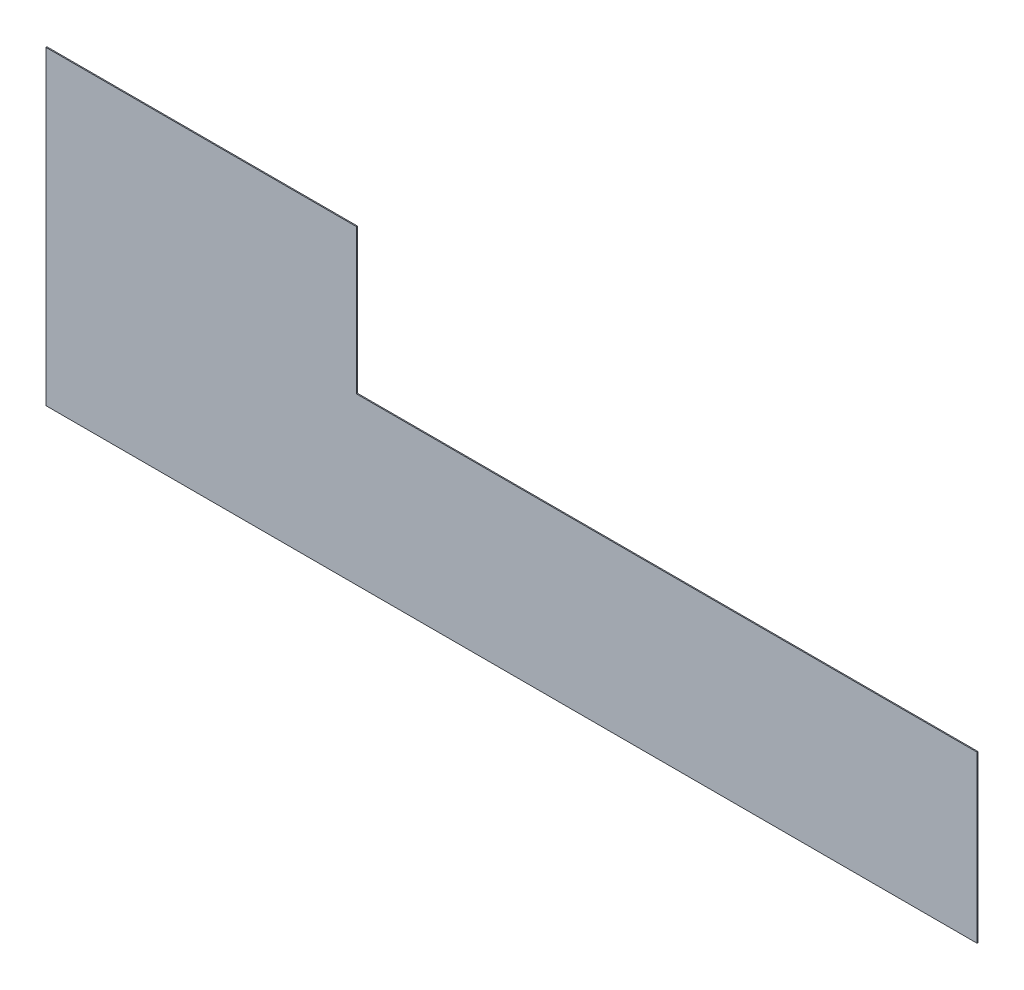
ISO-10303-21;
HEADER;
FILE_DESCRIPTION(('STEP AP214'),'2;1');
FILE_NAME('part.step','',(''),(''),'','','');
FILE_SCHEMA(('AUTOMOTIVE_DESIGN { 1 0 10303 214 1 1 1 1 }'));
ENDSEC;
DATA;
#1=APPLICATION_CONTEXT('core data for automotive mechanical design processes');
#2=APPLICATION_PROTOCOL_DEFINITION('international standard','automotive_design',2000,#1);
#3=PRODUCT_CONTEXT('',#1,'mechanical');
#4=PRODUCT('Part','Part','',(#3));
#5=PRODUCT_RELATED_PRODUCT_CATEGORY('part','',(#4));
#6=PRODUCT_DEFINITION_FORMATION('','',#4);
#7=PRODUCT_DEFINITION_CONTEXT('part definition',#1,'design');
#8=PRODUCT_DEFINITION('design','',#6,#7);
#9=PRODUCT_DEFINITION_SHAPE('','',#8);
#10=(LENGTH_UNIT() NAMED_UNIT(*) SI_UNIT(.MILLI.,.METRE.));
#11=(NAMED_UNIT(*) PLANE_ANGLE_UNIT() SI_UNIT($,.RADIAN.));
#12=(NAMED_UNIT(*) SI_UNIT($,.STERADIAN.) SOLID_ANGLE_UNIT());
#13=UNCERTAINTY_MEASURE_WITH_UNIT(LENGTH_MEASURE(1.E-05),#10,'distance_accuracy_value','');
#14=(GEOMETRIC_REPRESENTATION_CONTEXT(3) GLOBAL_UNCERTAINTY_ASSIGNED_CONTEXT((#13)) GLOBAL_UNIT_ASSIGNED_CONTEXT((#10,
#11,#12)) REPRESENTATION_CONTEXT('',''));
#15=CARTESIAN_POINT('',(0.,0.,0.));
#16=DIRECTION('',(0.,0.,1.));
#17=DIRECTION('',(1.,0.,0.));
#18=AXIS2_PLACEMENT_3D('',#15,#16,#17);
#19=CARTESIAN_POINT('',(455.448110470739,0.,1.));
#20=DIRECTION('',(-1.,0.,0.));
#21=DIRECTION('',(0.,0.,1.));
#22=AXIS2_PLACEMENT_3D('',#19,#20,#21);
#23=PLANE('',#22);
#24=DIRECTION('',(0.,1.,0.));
#25=VECTOR('',#24,1.);
#26=CARTESIAN_POINT('',(455.448110470739,0.,0.));
#27=LINE('',#26,#25);
#28=CARTESIAN_POINT('',(455.448110470739,-160.,0.));
#29=VERTEX_POINT('',#28);
#30=CARTESIAN_POINT('',(455.448110470739,0.,0.));
#31=VERTEX_POINT('',#30);
#32=EDGE_CURVE('E116',#29,#31,#27,.T.);
#33=ORIENTED_EDGE('',*,*,#32,.T.);
#34=DIRECTION('',(0.,0.,-1.));
#35=VECTOR('',#34,1.);
#36=CARTESIAN_POINT('',(455.448110470739,0.,1.));
#37=LINE('',#36,#35);
#38=CARTESIAN_POINT('',(455.448110470739,0.,1.));
#39=VERTEX_POINT('',#38);
#40=EDGE_CURVE('E11',#39,#31,#37,.T.);
#41=ORIENTED_EDGE('',*,*,#40,.F.);
#42=DIRECTION('',(0.,1.,0.));
#43=VECTOR('',#42,1.);
#44=CARTESIAN_POINT('',(455.448110470739,0.,1.));
#45=LINE('',#44,#43);
#46=CARTESIAN_POINT('',(455.448110470739,-160.,1.));
#47=VERTEX_POINT('',#46);
#48=EDGE_CURVE('E126',#47,#39,#45,.T.);
#49=ORIENTED_EDGE('',*,*,#48,.F.);
#50=DIRECTION('',(0.,0.,-1.));
#51=VECTOR('',#50,1.);
#52=CARTESIAN_POINT('',(455.448110470739,-160.,1.));
#53=LINE('',#52,#51);
#54=EDGE_CURVE('E112',#47,#29,#53,.T.);
#55=ORIENTED_EDGE('',*,*,#54,.T.);
#56=EDGE_LOOP('',(#33,#41,#49,#55));
#57=FACE_BOUND('',#56,.T.);
#58=ADVANCED_FACE('F32',(#57),#23,.F.);
#59=CARTESIAN_POINT('',(-144.551889529261,0.,1.));
#60=DIRECTION('',(0.,-1.,0.));
#61=DIRECTION('',(0.,0.,-1.));
#62=AXIS2_PLACEMENT_3D('',#59,#60,#61);
#63=PLANE('',#62);
#64=DIRECTION('',(-1.,0.,0.));
#65=VECTOR('',#64,1.);
#66=CARTESIAN_POINT('',(-144.551889529261,0.,0.));
#67=LINE('',#66,#65);
#68=CARTESIAN_POINT('',(-144.551889529261,0.,0.));
#69=VERTEX_POINT('',#68);
#70=EDGE_CURVE('E119',#31,#69,#67,.T.);
#71=ORIENTED_EDGE('',*,*,#70,.T.);
#72=DIRECTION('',(0.,0.,-1.));
#73=VECTOR('',#72,1.);
#74=CARTESIAN_POINT('',(-144.551889529261,0.,1.));
#75=LINE('',#74,#73);
#76=CARTESIAN_POINT('',(-144.551889529261,0.,1.));
#77=VERTEX_POINT('',#76);
#78=EDGE_CURVE('E40',#77,#69,#75,.T.);
#79=ORIENTED_EDGE('',*,*,#78,.F.);
#80=DIRECTION('',(-1.,0.,0.));
#81=VECTOR('',#80,1.);
#82=CARTESIAN_POINT('',(-144.551889529261,0.,1.));
#83=LINE('',#82,#81);
#84=EDGE_CURVE('E85',#39,#77,#83,.T.);
#85=ORIENTED_EDGE('',*,*,#84,.F.);
#86=ORIENTED_EDGE('',*,*,#40,.T.);
#87=EDGE_LOOP('',(#71,#79,#85,#86));
#88=FACE_BOUND('',#87,.T.);
#89=ADVANCED_FACE('F150',(#88),#63,.F.);
#90=CARTESIAN_POINT('',(-144.551889529261,0.,1.));
#91=DIRECTION('',(-1.,0.,0.));
#92=DIRECTION('',(0.,0.,1.));
#93=AXIS2_PLACEMENT_3D('',#90,#91,#92);
#94=PLANE('',#93);
#95=DIRECTION('',(0.,1.,0.));
#96=VECTOR('',#95,1.);
#97=CARTESIAN_POINT('',(-144.551889529261,0.,0.));
#98=LINE('',#97,#96);
#99=CARTESIAN_POINT('',(-144.551889529261,140.,0.));
#100=VERTEX_POINT('',#99);
#101=EDGE_CURVE('E121',#69,#100,#98,.T.);
#102=ORIENTED_EDGE('',*,*,#101,.T.);
#103=DIRECTION('',(0.,0.,-1.));
#104=VECTOR('',#103,1.);
#105=CARTESIAN_POINT('',(-144.551889529261,140.,1.));
#106=LINE('',#105,#104);
#107=CARTESIAN_POINT('',(-144.551889529261,140.,1.));
#108=VERTEX_POINT('',#107);
#109=EDGE_CURVE('E107',#108,#100,#106,.T.);
#110=ORIENTED_EDGE('',*,*,#109,.F.);
#111=DIRECTION('',(0.,1.,0.));
#112=VECTOR('',#111,1.);
#113=CARTESIAN_POINT('',(-144.551889529261,0.,1.));
#114=LINE('',#113,#112);
#115=EDGE_CURVE('E98',#77,#108,#114,.T.);
#116=ORIENTED_EDGE('',*,*,#115,.F.);
#117=ORIENTED_EDGE('',*,*,#78,.T.);
#118=EDGE_LOOP('',(#102,#110,#116,#117));
#119=FACE_BOUND('',#118,.T.);
#120=ADVANCED_FACE('F132',(#119),#94,.F.);
#121=CARTESIAN_POINT('',(-444.551889529261,140.,1.));
#122=DIRECTION('',(0.,-1.,0.));
#123=DIRECTION('',(0.,0.,-1.));
#124=AXIS2_PLACEMENT_3D('',#121,#122,#123);
#125=PLANE('',#124);
#126=DIRECTION('',(-1.,0.,0.));
#127=VECTOR('',#126,1.);
#128=CARTESIAN_POINT('',(-444.551889529261,140.,0.));
#129=LINE('',#128,#127);
#130=CARTESIAN_POINT('',(-444.551889529261,140.,0.));
#131=VERTEX_POINT('',#130);
#132=EDGE_CURVE('E106',#100,#131,#129,.T.);
#133=ORIENTED_EDGE('',*,*,#132,.T.);
#134=DIRECTION('',(0.,0.,-1.));
#135=VECTOR('',#134,1.);
#136=CARTESIAN_POINT('',(-444.551889529261,140.,1.));
#137=LINE('',#136,#135);
#138=CARTESIAN_POINT('',(-444.551889529261,140.,1.));
#139=VERTEX_POINT('',#138);
#140=EDGE_CURVE('E103',#139,#131,#137,.T.);
#141=ORIENTED_EDGE('',*,*,#140,.F.);
#142=DIRECTION('',(-1.,0.,0.));
#143=VECTOR('',#142,1.);
#144=CARTESIAN_POINT('',(-444.551889529261,140.,1.));
#145=LINE('',#144,#143);
#146=EDGE_CURVE('E92',#108,#139,#145,.T.);
#147=ORIENTED_EDGE('',*,*,#146,.F.);
#148=ORIENTED_EDGE('',*,*,#109,.T.);
#149=EDGE_LOOP('',(#133,#141,#147,#148));
#150=FACE_BOUND('',#149,.T.);
#151=ADVANCED_FACE('F104',(#150),#125,.F.);
#152=CARTESIAN_POINT('',(-444.551889529261,140.,1.));
#153=DIRECTION('',(1.,0.,0.));
#154=DIRECTION('',(0.,1.,0.));
#155=AXIS2_PLACEMENT_3D('',#152,#153,#154);
#156=PLANE('',#155);
#157=DIRECTION('',(0.,-1.,0.));
#158=VECTOR('',#157,1.);
#159=CARTESIAN_POINT('',(-444.551889529261,140.,0.));
#160=LINE('',#159,#158);
#161=CARTESIAN_POINT('',(-444.551889529261,-160.,0.));
#162=VERTEX_POINT('',#161);
#163=EDGE_CURVE('E71',#131,#162,#160,.T.);
#164=ORIENTED_EDGE('',*,*,#163,.T.);
#165=DIRECTION('',(0.,0.,-1.));
#166=VECTOR('',#165,1.);
#167=CARTESIAN_POINT('',(-444.551889529261,-160.,1.));
#168=LINE('',#167,#166);
#169=CARTESIAN_POINT('',(-444.551889529261,-160.,1.));
#170=VERTEX_POINT('',#169);
#171=EDGE_CURVE('E108',#170,#162,#168,.T.);
#172=ORIENTED_EDGE('',*,*,#171,.F.);
#173=DIRECTION('',(0.,-1.,0.));
#174=VECTOR('',#173,1.);
#175=CARTESIAN_POINT('',(-444.551889529261,140.,1.));
#176=LINE('',#175,#174);
#177=EDGE_CURVE('E96',#139,#170,#176,.T.);
#178=ORIENTED_EDGE('',*,*,#177,.F.);
#179=ORIENTED_EDGE('',*,*,#140,.T.);
#180=EDGE_LOOP('',(#164,#172,#178,#179));
#181=FACE_BOUND('',#180,.T.);
#182=ADVANCED_FACE('F110',(#181),#156,.F.);
#183=CARTESIAN_POINT('',(-444.551889529261,-160.,1.));
#184=DIRECTION('',(0.,1.,0.));
#185=DIRECTION('',(-1.,0.,0.));
#186=AXIS2_PLACEMENT_3D('',#183,#184,#185);
#187=PLANE('',#186);
#188=DIRECTION('',(1.,0.,0.));
#189=VECTOR('',#188,1.);
#190=CARTESIAN_POINT('',(-444.551889529261,-160.,0.));
#191=LINE('',#190,#189);
#192=EDGE_CURVE('E77',#162,#29,#191,.T.);
#193=ORIENTED_EDGE('',*,*,#192,.T.);
#194=ORIENTED_EDGE('',*,*,#54,.F.);
#195=DIRECTION('',(1.,0.,0.));
#196=VECTOR('',#195,1.);
#197=CARTESIAN_POINT('',(-444.551889529261,-160.,1.));
#198=LINE('',#197,#196);
#199=EDGE_CURVE('E48',#170,#47,#198,.T.);
#200=ORIENTED_EDGE('',*,*,#199,.F.);
#201=ORIENTED_EDGE('',*,*,#171,.T.);
#202=EDGE_LOOP('',(#193,#194,#200,#201));
#203=FACE_BOUND('',#202,.T.);
#204=ADVANCED_FACE('F139',(#203),#187,.F.);
#205=CARTESIAN_POINT('',(0.,0.,1.));
#206=DIRECTION('',(0.,0.,1.));
#207=DIRECTION('',(1.,0.,0.));
#208=AXIS2_PLACEMENT_3D('',#205,#206,#207);
#209=PLANE('',#208);
#210=ORIENTED_EDGE('',*,*,#48,.T.);
#211=ORIENTED_EDGE('',*,*,#84,.T.);
#212=ORIENTED_EDGE('',*,*,#115,.T.);
#213=ORIENTED_EDGE('',*,*,#146,.T.);
#214=ORIENTED_EDGE('',*,*,#177,.T.);
#215=ORIENTED_EDGE('',*,*,#199,.T.);
#216=EDGE_LOOP('',(#210,#211,#212,#213,#214,#215));
#217=FACE_BOUND('',#216,.T.);
#218=ADVANCED_FACE('F94',(#217),#209,.T.);
#219=CARTESIAN_POINT('',(0.,0.,0.));
#220=DIRECTION('',(0.,0.,1.));
#221=DIRECTION('',(1.,0.,0.));
#222=AXIS2_PLACEMENT_3D('',#219,#220,#221);
#223=PLANE('',#222);
#224=ORIENTED_EDGE('',*,*,#32,.F.);
#225=ORIENTED_EDGE('',*,*,#192,.F.);
#226=ORIENTED_EDGE('',*,*,#163,.F.);
#227=ORIENTED_EDGE('',*,*,#132,.F.);
#228=ORIENTED_EDGE('',*,*,#101,.F.);
#229=ORIENTED_EDGE('',*,*,#70,.F.);
#230=EDGE_LOOP('',(#224,#225,#226,#227,#228,#229));
#231=FACE_BOUND('',#230,.T.);
#232=ADVANCED_FACE('F135',(#231),#223,.F.);
#233=CLOSED_SHELL('',(#58,#89,#120,#151,#182,#204,#218,#232));
#234=MANIFOLD_SOLID_BREP('B2',#233);
#235=ADVANCED_BREP_SHAPE_REPRESENTATION('',(#18,#234),#14);
#236=SHAPE_DEFINITION_REPRESENTATION(#9,#235);
ENDSEC;
END-ISO-10303-21;
